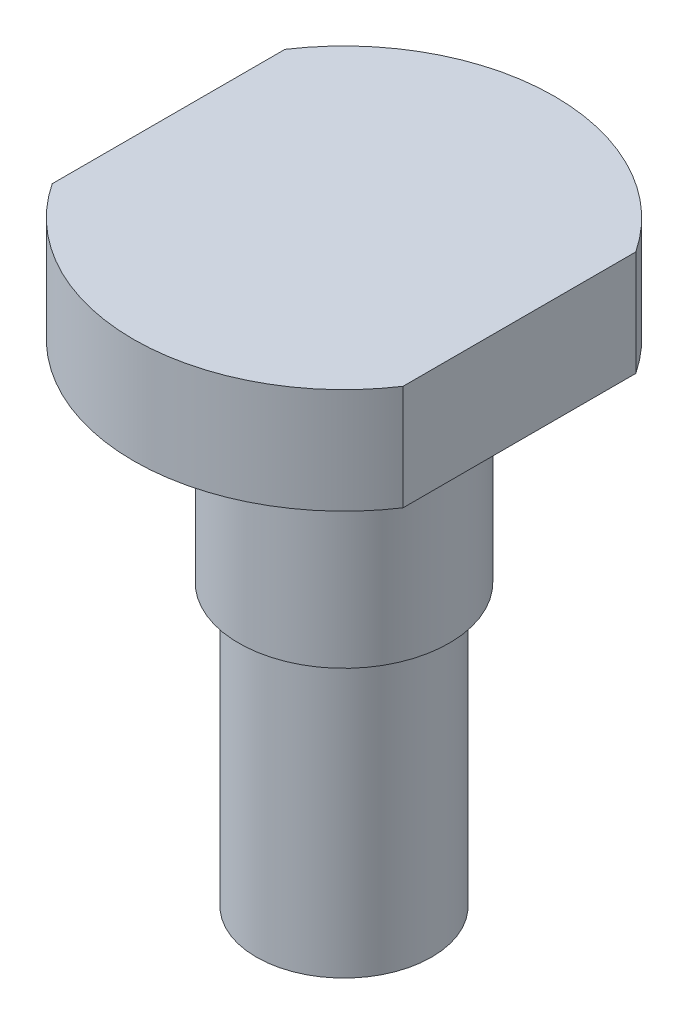
ISO-10303-21;
HEADER;
FILE_DESCRIPTION(('STEP AP214'),'2;1');
FILE_NAME('part.step','',(''),(''),'','','');
FILE_SCHEMA(('AUTOMOTIVE_DESIGN { 1 0 10303 214 1 1 1 1 }'));
ENDSEC;
DATA;
#1=APPLICATION_CONTEXT('core data for automotive mechanical design processes');
#2=APPLICATION_PROTOCOL_DEFINITION('international standard','automotive_design',2000,#1);
#3=PRODUCT_CONTEXT('',#1,'mechanical');
#4=PRODUCT('Part','Part','',(#3));
#5=PRODUCT_RELATED_PRODUCT_CATEGORY('part','',(#4));
#6=PRODUCT_DEFINITION_FORMATION('','',#4);
#7=PRODUCT_DEFINITION_CONTEXT('part definition',#1,'design');
#8=PRODUCT_DEFINITION('design','',#6,#7);
#9=PRODUCT_DEFINITION_SHAPE('','',#8);
#10=(LENGTH_UNIT() NAMED_UNIT(*) SI_UNIT(.MILLI.,.METRE.));
#11=(NAMED_UNIT(*) PLANE_ANGLE_UNIT() SI_UNIT($,.RADIAN.));
#12=(NAMED_UNIT(*) SI_UNIT($,.STERADIAN.) SOLID_ANGLE_UNIT());
#13=UNCERTAINTY_MEASURE_WITH_UNIT(LENGTH_MEASURE(1.E-05),#10,'distance_accuracy_value','');
#14=(GEOMETRIC_REPRESENTATION_CONTEXT(3) GLOBAL_UNCERTAINTY_ASSIGNED_CONTEXT((#13)) GLOBAL_UNIT_ASSIGNED_CONTEXT((#10,
#11,#12)) REPRESENTATION_CONTEXT('',''));
#15=CARTESIAN_POINT('',(0.,0.,0.));
#16=DIRECTION('',(0.,0.,1.));
#17=DIRECTION('',(1.,0.,0.));
#18=AXIS2_PLACEMENT_3D('',#15,#16,#17);
#19=CARTESIAN_POINT('',(0.,0.,0.));
#20=DIRECTION('',(0.,-1.,0.));
#21=DIRECTION('',(0.,0.,-1.));
#22=AXIS2_PLACEMENT_3D('',#19,#20,#21);
#23=CYLINDRICAL_SURFACE('',#22,6.);
#24=DIRECTION('',(0.,-1.,0.));
#25=VECTOR('',#24,1.);
#26=CARTESIAN_POINT('',(5.,0.,-3.3166247903554));
#27=LINE('',#26,#25);
#28=CARTESIAN_POINT('',(5.,14.,-3.3166247903554));
#29=VERTEX_POINT('',#28);
#30=CARTESIAN_POINT('',(5.,17.,-3.3166247903554));
#31=VERTEX_POINT('',#30);
#32=EDGE_CURVE('E47',#29,#31,#27,.F.);
#33=ORIENTED_EDGE('',*,*,#32,.F.);
#34=CARTESIAN_POINT('',(0.,14.,0.));
#35=DIRECTION('',(0.,-1.,0.));
#36=DIRECTION('',(0.,0.,-1.));
#37=AXIS2_PLACEMENT_3D('',#34,#35,#36);
#38=CIRCLE('',#37,6.);
#39=CARTESIAN_POINT('',(-5.,14.,-3.3166247903554));
#40=VERTEX_POINT('',#39);
#41=EDGE_CURVE('E92',#40,#29,#38,.T.);
#42=ORIENTED_EDGE('',*,*,#41,.F.);
#43=DIRECTION('',(0.,-1.,0.));
#44=VECTOR('',#43,1.);
#45=CARTESIAN_POINT('',(-5.,0.,-3.3166247903554));
#46=LINE('',#45,#44);
#47=CARTESIAN_POINT('',(-5.,17.,-3.3166247903554));
#48=VERTEX_POINT('',#47);
#49=EDGE_CURVE('E110',#48,#40,#46,.T.);
#50=ORIENTED_EDGE('',*,*,#49,.F.);
#51=CARTESIAN_POINT('',(0.,17.,0.));
#52=DIRECTION('',(0.,-1.,0.));
#53=DIRECTION('',(0.,0.,-1.));
#54=AXIS2_PLACEMENT_3D('',#51,#52,#53);
#55=CIRCLE('',#54,6.);
#56=EDGE_CURVE('E85',#48,#31,#55,.T.);
#57=ORIENTED_EDGE('',*,*,#56,.T.);
#58=EDGE_LOOP('',(#33,#42,#50,#57));
#59=FACE_BOUND('',#58,.T.);
#60=ADVANCED_FACE('F33',(#59),#23,.T.);
#61=CARTESIAN_POINT('',(0.,0.,0.));
#62=DIRECTION('',(0.,-1.,0.));
#63=DIRECTION('',(0.,0.,-1.));
#64=AXIS2_PLACEMENT_3D('',#61,#62,#63);
#65=PLANE('',#64);
#66=CARTESIAN_POINT('',(0.,0.,0.));
#67=DIRECTION('',(0.,-1.,0.));
#68=DIRECTION('',(0.,0.,-1.));
#69=AXIS2_PLACEMENT_3D('',#66,#67,#68);
#70=CIRCLE('',#69,2.5);
#71=CARTESIAN_POINT('',(0.,0.,-2.5));
#72=VERTEX_POINT('',#71);
#73=EDGE_CURVE('E104',#72,#72,#70,.T.);
#74=ORIENTED_EDGE('',*,*,#73,.T.);
#75=EDGE_LOOP('',(#74));
#76=FACE_BOUND('',#75,.T.);
#77=ADVANCED_FACE('F35',(#76),#65,.T.);
#78=CARTESIAN_POINT('',(0.,0.,0.));
#79=DIRECTION('',(0.,-1.,0.));
#80=DIRECTION('',(0.,0.,-1.));
#81=AXIS2_PLACEMENT_3D('',#78,#79,#80);
#82=CYLINDRICAL_SURFACE('',#81,2.5);
#83=CARTESIAN_POINT('',(0.,8.,0.));
#84=DIRECTION('',(0.,-1.,0.));
#85=DIRECTION('',(0.,0.,-1.));
#86=AXIS2_PLACEMENT_3D('',#83,#84,#85);
#87=CIRCLE('',#86,2.5);
#88=CARTESIAN_POINT('',(0.,8.,-2.5));
#89=VERTEX_POINT('',#88);
#90=EDGE_CURVE('E101',#89,#89,#87,.T.);
#91=ORIENTED_EDGE('',*,*,#90,.T.);
#92=EDGE_LOOP('',(#91));
#93=FACE_BOUND('',#92,.T.);
#94=ORIENTED_EDGE('',*,*,#73,.F.);
#95=EDGE_LOOP('',(#94));
#96=FACE_BOUND('',#95,.T.);
#97=ADVANCED_FACE('F133',(#93,#96),#82,.T.);
#98=CARTESIAN_POINT('',(0.,8.,-2.5));
#99=DIRECTION('',(0.,-1.,0.));
#100=DIRECTION('',(0.,0.,-1.));
#101=AXIS2_PLACEMENT_3D('',#98,#99,#100);
#102=PLANE('',#101);
#103=CARTESIAN_POINT('',(0.,8.,0.));
#104=DIRECTION('',(0.,-1.,0.));
#105=DIRECTION('',(0.,0.,-1.));
#106=AXIS2_PLACEMENT_3D('',#103,#104,#105);
#107=CIRCLE('',#106,3.);
#108=CARTESIAN_POINT('',(0.,8.,-3.));
#109=VERTEX_POINT('',#108);
#110=EDGE_CURVE('E98',#109,#109,#107,.T.);
#111=ORIENTED_EDGE('',*,*,#110,.T.);
#112=EDGE_LOOP('',(#111));
#113=FACE_BOUND('',#112,.T.);
#114=ORIENTED_EDGE('',*,*,#90,.F.);
#115=EDGE_LOOP('',(#114));
#116=FACE_BOUND('',#115,.T.);
#117=ADVANCED_FACE('F127',(#113,#116),#102,.T.);
#118=CARTESIAN_POINT('',(0.,0.,0.));
#119=DIRECTION('',(0.,-1.,0.));
#120=DIRECTION('',(0.,0.,-1.));
#121=AXIS2_PLACEMENT_3D('',#118,#119,#120);
#122=CYLINDRICAL_SURFACE('',#121,3.);
#123=CARTESIAN_POINT('',(0.,14.,0.));
#124=DIRECTION('',(0.,-1.,0.));
#125=DIRECTION('',(0.,0.,-1.));
#126=AXIS2_PLACEMENT_3D('',#123,#124,#125);
#127=CIRCLE('',#126,3.);
#128=CARTESIAN_POINT('',(0.,14.,-3.));
#129=VERTEX_POINT('',#128);
#130=EDGE_CURVE('E95',#129,#129,#127,.T.);
#131=ORIENTED_EDGE('',*,*,#130,.T.);
#132=EDGE_LOOP('',(#131));
#133=FACE_BOUND('',#132,.T.);
#134=ORIENTED_EDGE('',*,*,#110,.F.);
#135=EDGE_LOOP('',(#134));
#136=FACE_BOUND('',#135,.T.);
#137=ADVANCED_FACE('F121',(#133,#136),#122,.T.);
#138=CARTESIAN_POINT('',(0.,14.,-3.));
#139=DIRECTION('',(0.,-1.,0.));
#140=DIRECTION('',(0.,0.,-1.));
#141=AXIS2_PLACEMENT_3D('',#138,#139,#140);
#142=PLANE('',#141);
#143=DIRECTION('',(0.,0.,-1.));
#144=VECTOR('',#143,1.);
#145=CARTESIAN_POINT('',(5.,14.,-3.));
#146=LINE('',#145,#144);
#147=CARTESIAN_POINT('',(5.,14.,3.3166247903554));
#148=VERTEX_POINT('',#147);
#149=EDGE_CURVE('E81',#148,#29,#146,.T.);
#150=ORIENTED_EDGE('',*,*,#149,.F.);
#151=CARTESIAN_POINT('',(-5.,14.,3.3166247903554));
#152=VERTEX_POINT('',#151);
#153=EDGE_CURVE('E80',#148,#152,#38,.T.);
#154=ORIENTED_EDGE('',*,*,#153,.T.);
#155=DIRECTION('',(0.,0.,1.));
#156=VECTOR('',#155,1.);
#157=CARTESIAN_POINT('',(-5.,14.,-3.));
#158=LINE('',#157,#156);
#159=EDGE_CURVE('E88',#40,#152,#158,.T.);
#160=ORIENTED_EDGE('',*,*,#159,.F.);
#161=ORIENTED_EDGE('',*,*,#41,.T.);
#162=EDGE_LOOP('',(#150,#154,#160,#161));
#163=FACE_BOUND('',#162,.T.);
#164=ORIENTED_EDGE('',*,*,#130,.F.);
#165=EDGE_LOOP('',(#164));
#166=FACE_BOUND('',#165,.T.);
#167=ADVANCED_FACE('F118',(#163,#166),#142,.T.);
#168=DIRECTION('',(0.,-1.,0.));
#169=VECTOR('',#168,1.);
#170=CARTESIAN_POINT('',(5.,0.,3.3166247903554));
#171=LINE('',#170,#169);
#172=CARTESIAN_POINT('',(5.,17.,3.3166247903554));
#173=VERTEX_POINT('',#172);
#174=EDGE_CURVE('E73',#173,#148,#171,.T.);
#175=ORIENTED_EDGE('',*,*,#174,.F.);
#176=CARTESIAN_POINT('',(-5.,17.,3.3166247903554));
#177=VERTEX_POINT('',#176);
#178=EDGE_CURVE('E55',#173,#177,#55,.T.);
#179=ORIENTED_EDGE('',*,*,#178,.T.);
#180=DIRECTION('',(0.,-1.,0.));
#181=VECTOR('',#180,1.);
#182=CARTESIAN_POINT('',(-5.,0.,3.3166247903554));
#183=LINE('',#182,#181);
#184=EDGE_CURVE('E86',#152,#177,#183,.F.);
#185=ORIENTED_EDGE('',*,*,#184,.F.);
#186=ORIENTED_EDGE('',*,*,#153,.F.);
#187=EDGE_LOOP('',(#175,#179,#185,#186));
#188=FACE_BOUND('',#187,.T.);
#189=ADVANCED_FACE('F79',(#188),#23,.T.);
#190=CARTESIAN_POINT('',(0.,17.,-6.));
#191=DIRECTION('',(0.,1.,0.));
#192=DIRECTION('',(0.,0.,1.));
#193=AXIS2_PLACEMENT_3D('',#190,#191,#192);
#194=PLANE('',#193);
#195=DIRECTION('',(0.,0.,1.));
#196=VECTOR('',#195,1.);
#197=CARTESIAN_POINT('',(5.,17.,-6.));
#198=LINE('',#197,#196);
#199=EDGE_CURVE('E11',#31,#173,#198,.T.);
#200=ORIENTED_EDGE('',*,*,#199,.F.);
#201=ORIENTED_EDGE('',*,*,#56,.F.);
#202=DIRECTION('',(0.,0.,-1.));
#203=VECTOR('',#202,1.);
#204=CARTESIAN_POINT('',(-5.,17.,-6.));
#205=LINE('',#204,#203);
#206=EDGE_CURVE('E41',#177,#48,#205,.T.);
#207=ORIENTED_EDGE('',*,*,#206,.F.);
#208=ORIENTED_EDGE('',*,*,#178,.F.);
#209=EDGE_LOOP('',(#200,#201,#207,#208));
#210=FACE_BOUND('',#209,.T.);
#211=ADVANCED_FACE('F84',(#210),#194,.T.);
#212=CARTESIAN_POINT('',(-5.,7.,4.));
#213=DIRECTION('',(1.,0.,0.));
#214=DIRECTION('',(0.,0.,-1.));
#215=AXIS2_PLACEMENT_3D('',#212,#213,#214);
#216=PLANE('',#215);
#217=ORIENTED_EDGE('',*,*,#184,.T.);
#218=ORIENTED_EDGE('',*,*,#206,.T.);
#219=ORIENTED_EDGE('',*,*,#49,.T.);
#220=ORIENTED_EDGE('',*,*,#159,.T.);
#221=EDGE_LOOP('',(#217,#218,#219,#220));
#222=FACE_BOUND('',#221,.T.);
#223=ADVANCED_FACE('F108',(#222),#216,.F.);
#224=CARTESIAN_POINT('',(5.,7.,4.));
#225=DIRECTION('',(-1.,0.,0.));
#226=DIRECTION('',(0.,0.,1.));
#227=AXIS2_PLACEMENT_3D('',#224,#225,#226);
#228=PLANE('',#227);
#229=ORIENTED_EDGE('',*,*,#32,.T.);
#230=ORIENTED_EDGE('',*,*,#199,.T.);
#231=ORIENTED_EDGE('',*,*,#174,.T.);
#232=ORIENTED_EDGE('',*,*,#149,.T.);
#233=EDGE_LOOP('',(#229,#230,#231,#232));
#234=FACE_BOUND('',#233,.T.);
#235=ADVANCED_FACE('F72',(#234),#228,.F.);
#236=CLOSED_SHELL('',(#60,#77,#97,#117,#137,#167,#189,#211,#223,#235));
#237=MANIFOLD_SOLID_BREP('B2',#236);
#238=ADVANCED_BREP_SHAPE_REPRESENTATION('',(#18,#237),#14);
#239=SHAPE_DEFINITION_REPRESENTATION(#9,#238);
ENDSEC;
END-ISO-10303-21;
